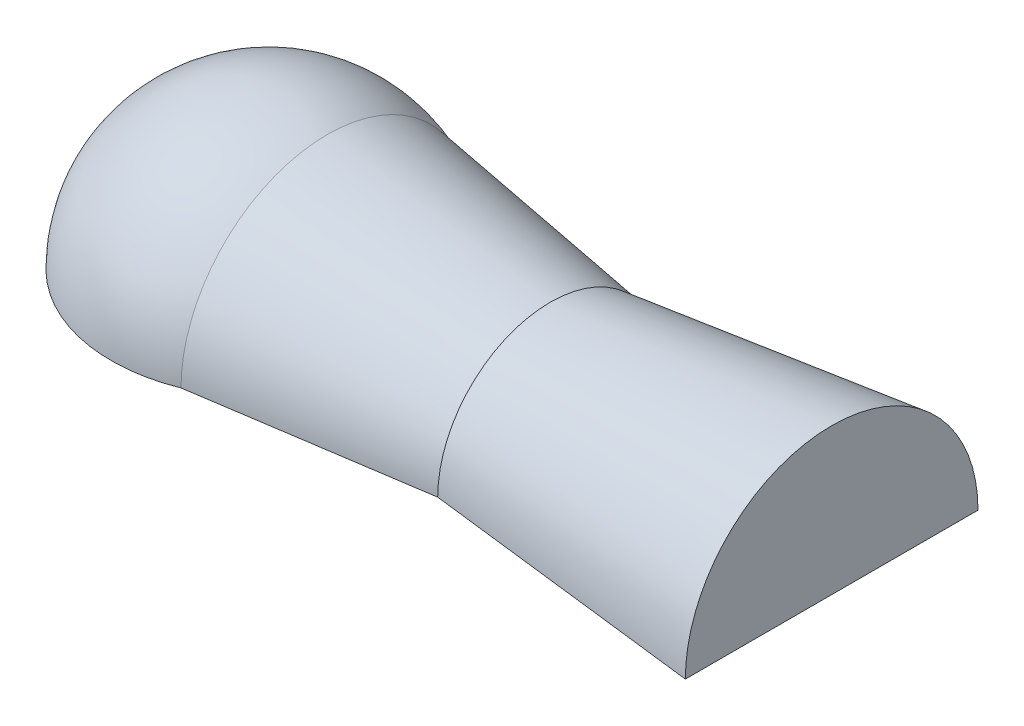
ISO-10303-21;
HEADER;
FILE_DESCRIPTION(('STEP AP214'),'2;1');
FILE_NAME('part.step','',(''),(''),'','','');
FILE_SCHEMA(('AUTOMOTIVE_DESIGN { 1 0 10303 214 1 1 1 1 }'));
ENDSEC;
DATA;
#1=APPLICATION_CONTEXT('core data for automotive mechanical design processes');
#2=APPLICATION_PROTOCOL_DEFINITION('international standard','automotive_design',2000,#1);
#3=PRODUCT_CONTEXT('',#1,'mechanical');
#4=PRODUCT('Part','Part','',(#3));
#5=PRODUCT_RELATED_PRODUCT_CATEGORY('part','',(#4));
#6=PRODUCT_DEFINITION_FORMATION('','',#4);
#7=PRODUCT_DEFINITION_CONTEXT('part definition',#1,'design');
#8=PRODUCT_DEFINITION('design','',#6,#7);
#9=PRODUCT_DEFINITION_SHAPE('','',#8);
#10=(LENGTH_UNIT() NAMED_UNIT(*) SI_UNIT(.MILLI.,.METRE.));
#11=(NAMED_UNIT(*) PLANE_ANGLE_UNIT() SI_UNIT($,.RADIAN.));
#12=(NAMED_UNIT(*) SI_UNIT($,.STERADIAN.) SOLID_ANGLE_UNIT());
#13=UNCERTAINTY_MEASURE_WITH_UNIT(LENGTH_MEASURE(1.E-05),#10,'distance_accuracy_value','');
#14=(GEOMETRIC_REPRESENTATION_CONTEXT(3) GLOBAL_UNCERTAINTY_ASSIGNED_CONTEXT((#13)) GLOBAL_UNIT_ASSIGNED_CONTEXT((#10,
#11,#12)) REPRESENTATION_CONTEXT('',''));
#15=CARTESIAN_POINT('',(0.,0.,0.));
#16=DIRECTION('',(0.,0.,1.));
#17=DIRECTION('',(1.,0.,0.));
#18=AXIS2_PLACEMENT_3D('',#15,#16,#17);
#19=CARTESIAN_POINT('',(250.,-4.53892574049607E-13,65.));
#20=DIRECTION('',(-1.,0.,0.));
#21=DIRECTION('',(0.,0.,1.));
#22=AXIS2_PLACEMENT_3D('',#19,#20,#21);
#23=PLANE('',#22);
#24=CARTESIAN_POINT('',(250.,0.,0.));
#25=DIRECTION('',(-1.,0.,0.));
#26=DIRECTION('',(0.,0.,1.));
#27=AXIS2_PLACEMENT_3D('',#24,#25,#26);
#28=CIRCLE('',#27,65.);
#29=CARTESIAN_POINT('',(250.,-4.53892574049607E-13,65.));
#30=VERTEX_POINT('',#29);
#31=CARTESIAN_POINT('',(250.,0.,-65.));
#32=VERTEX_POINT('',#31);
#33=EDGE_CURVE('E13',#30,#32,#28,.T.);
#34=ORIENTED_EDGE('',*,*,#33,.F.);
#35=DIRECTION('',(0.,0.,1.));
#36=VECTOR('',#35,1.);
#37=CARTESIAN_POINT('',(250.,-4.53892574049607E-13,65.));
#38=LINE('',#37,#36);
#39=EDGE_CURVE('E81',#32,#30,#38,.T.);
#40=ORIENTED_EDGE('',*,*,#39,.F.);
#41=EDGE_LOOP('',(#34,#40));
#42=FACE_BOUND('',#41,.T.);
#43=ADVANCED_FACE('F45',(#42),#23,.F.);
#44=CARTESIAN_POINT('',(250.,0.,0.));
#45=DIRECTION('',(1.,0.,0.));
#46=DIRECTION('',(0.,0.,-1.));
#47=AXIS2_PLACEMENT_3D('',#44,#45,#46);
#48=CONICAL_SURFACE('',#47,65.,0.119428926018338);
#49=CARTESIAN_POINT('',(125.,0.,0.));
#50=DIRECTION('',(-1.,0.,0.));
#51=DIRECTION('',(0.,0.,1.));
#52=AXIS2_PLACEMENT_3D('',#49,#50,#51);
#53=CIRCLE('',#52,50.);
#54=CARTESIAN_POINT('',(125.,-3.49148133884313E-13,50.));
#55=VERTEX_POINT('',#54);
#56=CARTESIAN_POINT('',(125.,0.,-50.));
#57=VERTEX_POINT('',#56);
#58=EDGE_CURVE('E53',#55,#57,#53,.T.);
#59=ORIENTED_EDGE('',*,*,#58,.F.);
#60=DIRECTION('',(-0.992876838486922,0.,-0.119145220618431));
#61=VECTOR('',#60,1.);
#62=CARTESIAN_POINT('',(125.,-3.49148133884313E-13,50.));
#63=LINE('',#62,#61);
#64=EDGE_CURVE('E84',#30,#55,#63,.T.);
#65=ORIENTED_EDGE('',*,*,#64,.F.);
#66=ORIENTED_EDGE('',*,*,#33,.T.);
#67=DIRECTION('',(-0.992876838486922,0.,0.119145220618431));
#68=VECTOR('',#67,1.);
#69=CARTESIAN_POINT('',(125.,0.,-50.));
#70=LINE('',#69,#68);
#71=EDGE_CURVE('E87',#32,#57,#70,.T.);
#72=ORIENTED_EDGE('',*,*,#71,.T.);
#73=EDGE_LOOP('',(#59,#65,#66,#72));
#74=FACE_BOUND('',#73,.T.);
#75=ADVANCED_FACE('F47',(#74),#48,.T.);
#76=CARTESIAN_POINT('',(125.,0.,0.));
#77=DIRECTION('',(-1.,0.,0.));
#78=DIRECTION('',(0.,0.,1.));
#79=AXIS2_PLACEMENT_3D('',#76,#77,#78);
#80=CONICAL_SURFACE('',#79,50.,0.150342651477057);
#81=CARTESIAN_POINT('',(25.9807621135332,0.,0.));
#82=DIRECTION('',(-1.,0.,0.));
#83=DIRECTION('',(0.,0.,1.));
#84=AXIS2_PLACEMENT_3D('',#81,#82,#83);
#85=CIRCLE('',#84,65.);
#86=CARTESIAN_POINT('',(25.9807621135332,-4.53892574049607E-13,65.));
#87=VERTEX_POINT('',#86);
#88=CARTESIAN_POINT('',(25.9807621135332,0.,-65.));
#89=VERTEX_POINT('',#88);
#90=EDGE_CURVE('E60',#87,#89,#85,.T.);
#91=ORIENTED_EDGE('',*,*,#90,.F.);
#92=DIRECTION('',(-0.988719814694401,0.,0.149776927564527));
#93=VECTOR('',#92,1.);
#94=CARTESIAN_POINT('',(25.9807621135332,-4.53892574049607E-13,65.));
#95=LINE('',#94,#93);
#96=EDGE_CURVE('E94',#55,#87,#95,.T.);
#97=ORIENTED_EDGE('',*,*,#96,.F.);
#98=ORIENTED_EDGE('',*,*,#58,.T.);
#99=DIRECTION('',(-0.988719814694401,0.,-0.149776927564527));
#100=VECTOR('',#99,1.);
#101=CARTESIAN_POINT('',(25.9807621135332,0.,-65.));
#102=LINE('',#101,#100);
#103=EDGE_CURVE('E85',#57,#89,#102,.T.);
#104=ORIENTED_EDGE('',*,*,#103,.T.);
#105=EDGE_LOOP('',(#91,#97,#98,#104));
#106=FACE_BOUND('',#105,.T.);
#107=ADVANCED_FACE('F98',(#106),#80,.T.);
#108=CARTESIAN_POINT('',(0.,0.,0.));
#109=DIRECTION('',(-1.,0.,0.));
#110=DIRECTION('',(0.,0.,1.));
#111=AXIS2_PLACEMENT_3D('',#108,#109,#110);
#112=SPHERICAL_SURFACE('',#111,70.);
#113=ORIENTED_EDGE('',*,*,#90,.T.);
#114=CARTESIAN_POINT('',(0.,0.,0.));
#115=DIRECTION('',(0.,-1.,0.));
#116=DIRECTION('',(0.,0.,-1.));
#117=AXIS2_PLACEMENT_3D('',#114,#115,#116);
#118=CIRCLE('',#117,70.);
#119=EDGE_CURVE('E96',#87,#89,#118,.T.);
#120=ORIENTED_EDGE('',*,*,#119,.F.);
#121=EDGE_LOOP('',(#113,#120));
#122=FACE_BOUND('',#121,.T.);
#123=ADVANCED_FACE('F101',(#122),#112,.T.);
#124=CARTESIAN_POINT('',(0.,0.,0.));
#125=DIRECTION('',(0.,-1.,0.));
#126=DIRECTION('',(0.,0.,-1.));
#127=AXIS2_PLACEMENT_3D('',#124,#125,#126);
#128=PLANE('',#127);
#129=ORIENTED_EDGE('',*,*,#39,.T.);
#130=ORIENTED_EDGE('',*,*,#64,.T.);
#131=ORIENTED_EDGE('',*,*,#96,.T.);
#132=ORIENTED_EDGE('',*,*,#119,.T.);
#133=ORIENTED_EDGE('',*,*,#103,.F.);
#134=ORIENTED_EDGE('',*,*,#71,.F.);
#135=EDGE_LOOP('',(#129,#130,#131,#132,#133,#134));
#136=FACE_BOUND('',#135,.T.);
#137=ADVANCED_FACE('F89',(#136),#128,.T.);
#138=CLOSED_SHELL('',(#43,#75,#107,#123,#137));
#139=MANIFOLD_SOLID_BREP('B2',#138);
#140=ADVANCED_BREP_SHAPE_REPRESENTATION('',(#18,#139),#14);
#141=SHAPE_DEFINITION_REPRESENTATION(#9,#140);
ENDSEC;
END-ISO-10303-21;
